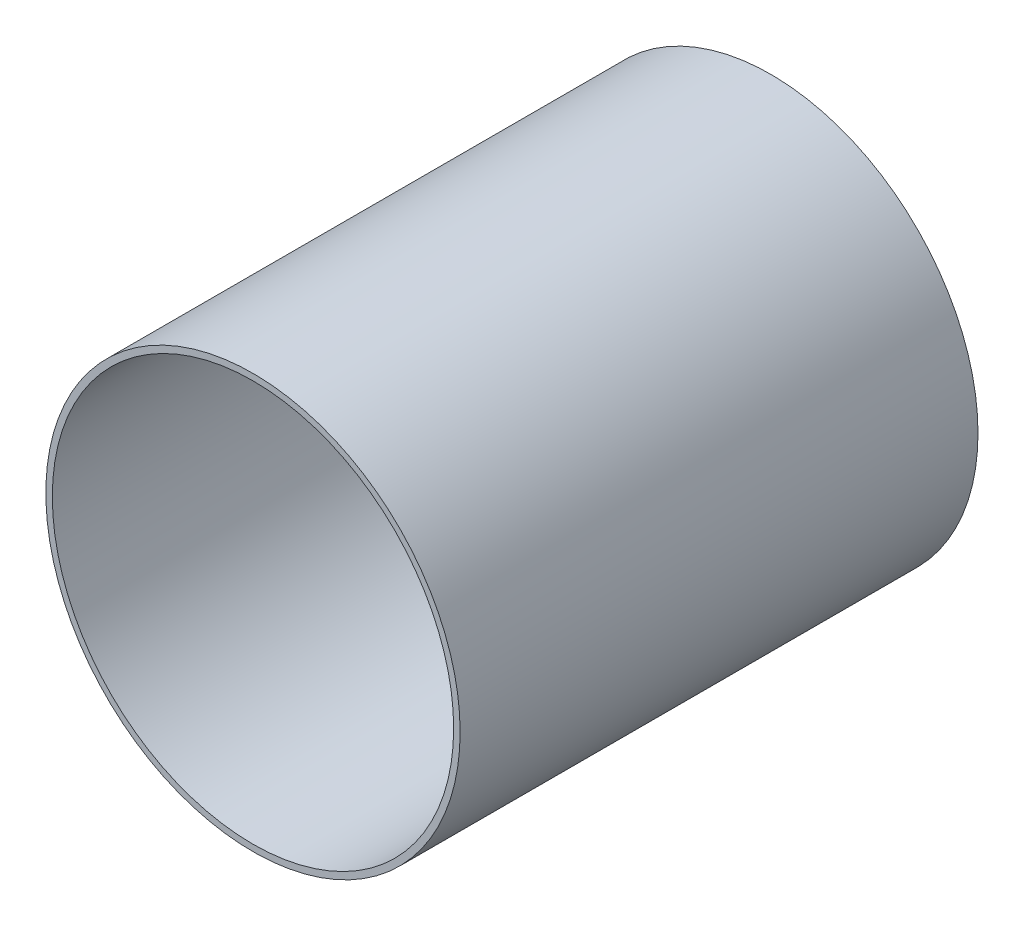
ISO-10303-21;
HEADER;
FILE_DESCRIPTION(('STEP AP214'),'2;1');
FILE_NAME('part.step','',(''),(''),'','','');
FILE_SCHEMA(('AUTOMOTIVE_DESIGN { 1 0 10303 214 1 1 1 1 }'));
ENDSEC;
DATA;
#1=APPLICATION_CONTEXT('core data for automotive mechanical design processes');
#2=APPLICATION_PROTOCOL_DEFINITION('international standard','automotive_design',2000,#1);
#3=PRODUCT_CONTEXT('',#1,'mechanical');
#4=PRODUCT('Part','Part','',(#3));
#5=PRODUCT_RELATED_PRODUCT_CATEGORY('part','',(#4));
#6=PRODUCT_DEFINITION_FORMATION('','',#4);
#7=PRODUCT_DEFINITION_CONTEXT('part definition',#1,'design');
#8=PRODUCT_DEFINITION('design','',#6,#7);
#9=PRODUCT_DEFINITION_SHAPE('','',#8);
#10=(LENGTH_UNIT() NAMED_UNIT(*) SI_UNIT(.MILLI.,.METRE.));
#11=(NAMED_UNIT(*) PLANE_ANGLE_UNIT() SI_UNIT($,.RADIAN.));
#12=(NAMED_UNIT(*) SI_UNIT($,.STERADIAN.) SOLID_ANGLE_UNIT());
#13=UNCERTAINTY_MEASURE_WITH_UNIT(LENGTH_MEASURE(1.E-05),#10,'distance_accuracy_value','');
#14=(GEOMETRIC_REPRESENTATION_CONTEXT(3) GLOBAL_UNCERTAINTY_ASSIGNED_CONTEXT((#13)) GLOBAL_UNIT_ASSIGNED_CONTEXT((#10,
#11,#12)) REPRESENTATION_CONTEXT('',''));
#15=CARTESIAN_POINT('',(0.,0.,0.));
#16=DIRECTION('',(0.,0.,1.));
#17=DIRECTION('',(1.,0.,0.));
#18=AXIS2_PLACEMENT_3D('',#15,#16,#17);
#19=CARTESIAN_POINT('',(0.,0.,200.));
#20=DIRECTION('',(0.,0.,-1.));
#21=DIRECTION('',(-1.,0.,0.));
#22=AXIS2_PLACEMENT_3D('',#19,#20,#21);
#23=CYLINDRICAL_SURFACE('',#22,80.);
#24=CARTESIAN_POINT('',(0.,0.,200.));
#25=DIRECTION('',(0.,0.,1.));
#26=DIRECTION('',(1.,0.,0.));
#27=AXIS2_PLACEMENT_3D('',#24,#25,#26);
#28=CIRCLE('',#27,80.);
#29=CARTESIAN_POINT('',(80.,0.,200.));
#30=VERTEX_POINT('',#29);
#31=EDGE_CURVE('E10',#30,#30,#28,.T.);
#32=ORIENTED_EDGE('',*,*,#31,.F.);
#33=EDGE_LOOP('',(#32));
#34=FACE_BOUND('',#33,.T.);
#35=CARTESIAN_POINT('',(0.,0.,0.));
#36=DIRECTION('',(0.,0.,1.));
#37=DIRECTION('',(1.,0.,0.));
#38=AXIS2_PLACEMENT_3D('',#35,#36,#37);
#39=CIRCLE('',#38,80.);
#40=CARTESIAN_POINT('',(80.,0.,0.));
#41=VERTEX_POINT('',#40);
#42=EDGE_CURVE('E40',#41,#41,#39,.T.);
#43=ORIENTED_EDGE('',*,*,#42,.T.);
#44=EDGE_LOOP('',(#43));
#45=FACE_BOUND('',#44,.T.);
#46=ADVANCED_FACE('F37',(#34,#45),#23,.T.);
#47=CARTESIAN_POINT('',(0.,0.,200.));
#48=DIRECTION('',(0.,0.,1.));
#49=DIRECTION('',(1.,0.,0.));
#50=AXIS2_PLACEMENT_3D('',#47,#48,#49);
#51=PLANE('',#50);
#52=CARTESIAN_POINT('',(0.,0.,200.));
#53=DIRECTION('',(0.,0.,1.));
#54=DIRECTION('',(1.,0.,0.));
#55=AXIS2_PLACEMENT_3D('',#52,#53,#54);
#56=CIRCLE('',#55,77.5);
#57=CARTESIAN_POINT('',(77.5,0.,200.));
#58=VERTEX_POINT('',#57);
#59=EDGE_CURVE('E51',#58,#58,#56,.T.);
#60=ORIENTED_EDGE('',*,*,#59,.F.);
#61=EDGE_LOOP('',(#60));
#62=FACE_BOUND('',#61,.T.);
#63=ORIENTED_EDGE('',*,*,#31,.T.);
#64=EDGE_LOOP('',(#63));
#65=FACE_BOUND('',#64,.T.);
#66=ADVANCED_FACE('F68',(#62,#65),#51,.T.);
#67=CARTESIAN_POINT('',(0.,0.,0.));
#68=DIRECTION('',(0.,0.,1.));
#69=DIRECTION('',(1.,0.,0.));
#70=AXIS2_PLACEMENT_3D('',#67,#68,#69);
#71=PLANE('',#70);
#72=ORIENTED_EDGE('',*,*,#42,.F.);
#73=EDGE_LOOP('',(#72));
#74=FACE_BOUND('',#73,.T.);
#75=ADVANCED_FACE('F64',(#74),#71,.F.);
#76=CARTESIAN_POINT('',(0.,0.,5.));
#77=DIRECTION('',(0.,0.,1.));
#78=DIRECTION('',(1.,0.,0.));
#79=AXIS2_PLACEMENT_3D('',#76,#77,#78);
#80=CYLINDRICAL_SURFACE('',#79,77.5);
#81=CARTESIAN_POINT('',(0.,0.,5.));
#82=DIRECTION('',(0.,0.,1.));
#83=DIRECTION('',(1.,0.,0.));
#84=AXIS2_PLACEMENT_3D('',#81,#82,#83);
#85=CIRCLE('',#84,77.5);
#86=CARTESIAN_POINT('',(77.5,0.,5.));
#87=VERTEX_POINT('',#86);
#88=EDGE_CURVE('E49',#87,#87,#85,.T.);
#89=ORIENTED_EDGE('',*,*,#88,.F.);
#90=EDGE_LOOP('',(#89));
#91=FACE_BOUND('',#90,.T.);
#92=ORIENTED_EDGE('',*,*,#59,.T.);
#93=EDGE_LOOP('',(#92));
#94=FACE_BOUND('',#93,.T.);
#95=ADVANCED_FACE('F61',(#91,#94),#80,.F.);
#96=CARTESIAN_POINT('',(0.,0.,5.));
#97=DIRECTION('',(0.,0.,1.));
#98=DIRECTION('',(1.,0.,0.));
#99=AXIS2_PLACEMENT_3D('',#96,#97,#98);
#100=PLANE('',#99);
#101=ORIENTED_EDGE('',*,*,#88,.T.);
#102=EDGE_LOOP('',(#101));
#103=FACE_BOUND('',#102,.T.);
#104=ADVANCED_FACE('F59',(#103),#100,.T.);
#105=CLOSED_SHELL('',(#46,#66,#75,#95,#104));
#106=MANIFOLD_SOLID_BREP('B2',#105);
#107=ADVANCED_BREP_SHAPE_REPRESENTATION('',(#18,#106),#14);
#108=SHAPE_DEFINITION_REPRESENTATION(#9,#107);
ENDSEC;
END-ISO-10303-21;
